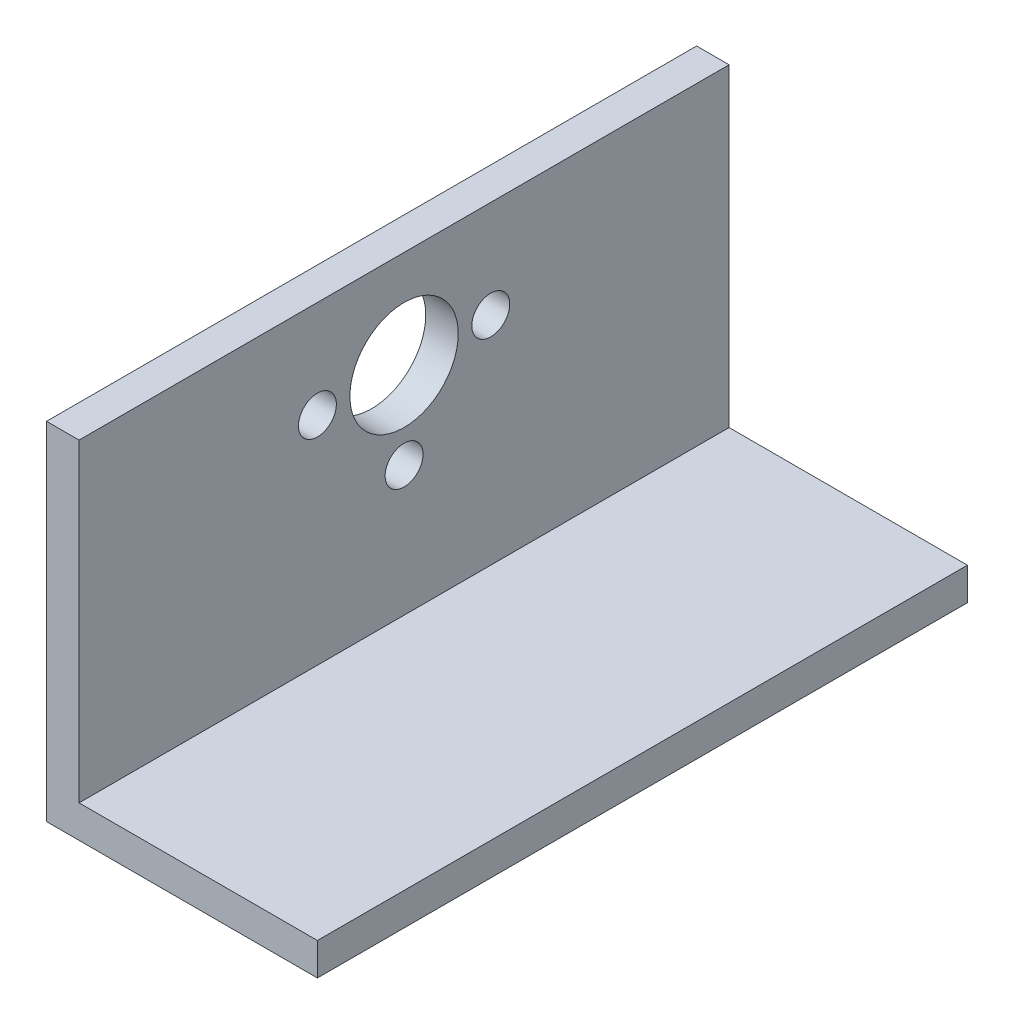
ISO-10303-21;
HEADER;
FILE_DESCRIPTION(('STEP AP214'),'2;1');
FILE_NAME('part.step','',(''),(''),'','','');
FILE_SCHEMA(('AUTOMOTIVE_DESIGN { 1 0 10303 214 1 1 1 1 }'));
ENDSEC;
DATA;
#1=APPLICATION_CONTEXT('core data for automotive mechanical design processes');
#2=APPLICATION_PROTOCOL_DEFINITION('international standard','automotive_design',2000,#1);
#3=PRODUCT_CONTEXT('',#1,'mechanical');
#4=PRODUCT('Part','Part','',(#3));
#5=PRODUCT_RELATED_PRODUCT_CATEGORY('part','',(#4));
#6=PRODUCT_DEFINITION_FORMATION('','',#4);
#7=PRODUCT_DEFINITION_CONTEXT('part definition',#1,'design');
#8=PRODUCT_DEFINITION('design','',#6,#7);
#9=PRODUCT_DEFINITION_SHAPE('','',#8);
#10=(LENGTH_UNIT() NAMED_UNIT(*) SI_UNIT(.MILLI.,.METRE.));
#11=(NAMED_UNIT(*) PLANE_ANGLE_UNIT() SI_UNIT($,.RADIAN.));
#12=(NAMED_UNIT(*) SI_UNIT($,.STERADIAN.) SOLID_ANGLE_UNIT());
#13=UNCERTAINTY_MEASURE_WITH_UNIT(LENGTH_MEASURE(1.E-05),#10,'distance_accuracy_value','');
#14=(GEOMETRIC_REPRESENTATION_CONTEXT(3) GLOBAL_UNCERTAINTY_ASSIGNED_CONTEXT((#13)) GLOBAL_UNIT_ASSIGNED_CONTEXT((#10,
#11,#12)) REPRESENTATION_CONTEXT('',''));
#15=CARTESIAN_POINT('',(0.,0.,0.));
#16=DIRECTION('',(0.,0.,1.));
#17=DIRECTION('',(1.,0.,0.));
#18=AXIS2_PLACEMENT_3D('',#15,#16,#17);
#19=CARTESIAN_POINT('',(-10.8974850351584,31.3475628083256,60.));
#20=DIRECTION('',(0.,-1.,0.));
#21=DIRECTION('',(0.,0.,-1.));
#22=AXIS2_PLACEMENT_3D('',#19,#20,#21);
#23=PLANE('',#22);
#24=DIRECTION('',(-1.,0.,0.));
#25=VECTOR('',#24,1.);
#26=CARTESIAN_POINT('',(-10.8974850351584,31.3475628083256,0.));
#27=LINE('',#26,#25);
#28=CARTESIAN_POINT('',(-7.89748503515838,31.3475628083256,0.));
#29=VERTEX_POINT('',#28);
#30=CARTESIAN_POINT('',(-10.8974850351584,31.3475628083256,0.));
#31=VERTEX_POINT('',#30);
#32=EDGE_CURVE('E117',#29,#31,#27,.T.);
#33=ORIENTED_EDGE('',*,*,#32,.T.);
#34=DIRECTION('',(0.,0.,-1.));
#35=VECTOR('',#34,1.);
#36=CARTESIAN_POINT('',(-10.8974850351584,31.3475628083256,60.));
#37=LINE('',#36,#35);
#38=CARTESIAN_POINT('',(-10.8974850351584,31.3475628083256,60.));
#39=VERTEX_POINT('',#38);
#40=EDGE_CURVE('E11',#39,#31,#37,.T.);
#41=ORIENTED_EDGE('',*,*,#40,.F.);
#42=DIRECTION('',(-1.,0.,0.));
#43=VECTOR('',#42,1.);
#44=CARTESIAN_POINT('',(-10.8974850351584,31.3475628083256,60.));
#45=LINE('',#44,#43);
#46=CARTESIAN_POINT('',(-7.89748503515838,31.3475628083256,60.));
#47=VERTEX_POINT('',#46);
#48=EDGE_CURVE('E128',#47,#39,#45,.T.);
#49=ORIENTED_EDGE('',*,*,#48,.F.);
#50=DIRECTION('',(0.,0.,-1.));
#51=VECTOR('',#50,1.);
#52=CARTESIAN_POINT('',(-7.89748503515838,31.3475628083256,60.));
#53=LINE('',#52,#51);
#54=EDGE_CURVE('E113',#47,#29,#53,.T.);
#55=ORIENTED_EDGE('',*,*,#54,.T.);
#56=EDGE_LOOP('',(#33,#41,#49,#55));
#57=FACE_BOUND('',#56,.T.);
#58=ADVANCED_FACE('F33',(#57),#23,.F.);
#59=CARTESIAN_POINT('',(-10.8974850351584,-0.652437191674368,60.));
#60=DIRECTION('',(1.,0.,0.));
#61=DIRECTION('',(0.,0.,-1.));
#62=AXIS2_PLACEMENT_3D('',#59,#60,#61);
#63=PLANE('',#62);
#64=CARTESIAN_POINT('',(-10.8974850351584,22.3475628083256,22.));
#65=DIRECTION('',(1.,0.,0.));
#66=DIRECTION('',(0.,0.,-1.));
#67=AXIS2_PLACEMENT_3D('',#64,#65,#66);
#68=CIRCLE('',#67,1.75);
#69=CARTESIAN_POINT('',(-10.8974850351584,22.3475628083256,20.25));
#70=VERTEX_POINT('',#69);
#71=EDGE_CURVE('E245',#70,#70,#68,.T.);
#72=ORIENTED_EDGE('',*,*,#71,.T.);
#73=EDGE_LOOP('',(#72));
#74=FACE_BOUND('',#73,.T.);
#75=CARTESIAN_POINT('',(-10.8974850351584,22.3475628083256,38.));
#76=DIRECTION('',(1.,0.,0.));
#77=DIRECTION('',(0.,0.,-1.));
#78=AXIS2_PLACEMENT_3D('',#75,#76,#77);
#79=CIRCLE('',#78,1.75);
#80=CARTESIAN_POINT('',(-10.8974850351584,22.3475628083256,36.25));
#81=VERTEX_POINT('',#80);
#82=EDGE_CURVE('E254',#81,#81,#79,.T.);
#83=ORIENTED_EDGE('',*,*,#82,.T.);
#84=EDGE_LOOP('',(#83));
#85=FACE_BOUND('',#84,.T.);
#86=CARTESIAN_POINT('',(-10.8974850351584,14.3475628083256,30.));
#87=DIRECTION('',(1.,0.,0.));
#88=DIRECTION('',(0.,0.,-1.));
#89=AXIS2_PLACEMENT_3D('',#86,#87,#88);
#90=CIRCLE('',#89,1.75);
#91=CARTESIAN_POINT('',(-10.8974850351584,14.3475628083256,28.25));
#92=VERTEX_POINT('',#91);
#93=EDGE_CURVE('E260',#92,#92,#90,.T.);
#94=ORIENTED_EDGE('',*,*,#93,.T.);
#95=EDGE_LOOP('',(#94));
#96=FACE_BOUND('',#95,.T.);
#97=CARTESIAN_POINT('',(-10.8974850351584,22.3475628083256,30.));
#98=DIRECTION('',(1.,0.,0.));
#99=DIRECTION('',(0.,0.,-1.));
#100=AXIS2_PLACEMENT_3D('',#97,#98,#99);
#101=CIRCLE('',#100,5.);
#102=CARTESIAN_POINT('',(-10.8974850351584,22.3475628083256,25.));
#103=VERTEX_POINT('',#102);
#104=EDGE_CURVE('E121',#103,#103,#101,.T.);
#105=ORIENTED_EDGE('',*,*,#104,.T.);
#106=EDGE_LOOP('',(#105));
#107=FACE_BOUND('',#106,.T.);
#108=DIRECTION('',(0.,-1.,0.));
#109=VECTOR('',#108,1.);
#110=CARTESIAN_POINT('',(-10.8974850351584,-0.652437191674368,0.));
#111=LINE('',#110,#109);
#112=CARTESIAN_POINT('',(-10.8974850351584,-0.652437191674368,0.));
#113=VERTEX_POINT('',#112);
#114=EDGE_CURVE('E120',#31,#113,#111,.T.);
#115=ORIENTED_EDGE('',*,*,#114,.T.);
#116=DIRECTION('',(0.,0.,-1.));
#117=VECTOR('',#116,1.);
#118=CARTESIAN_POINT('',(-10.8974850351584,-0.652437191674368,60.));
#119=LINE('',#118,#117);
#120=CARTESIAN_POINT('',(-10.8974850351584,-0.652437191674368,60.));
#121=VERTEX_POINT('',#120);
#122=EDGE_CURVE('E41',#121,#113,#119,.T.);
#123=ORIENTED_EDGE('',*,*,#122,.F.);
#124=DIRECTION('',(0.,-1.,0.));
#125=VECTOR('',#124,1.);
#126=CARTESIAN_POINT('',(-10.8974850351584,-0.652437191674368,60.));
#127=LINE('',#126,#125);
#128=EDGE_CURVE('E86',#39,#121,#127,.T.);
#129=ORIENTED_EDGE('',*,*,#128,.F.);
#130=ORIENTED_EDGE('',*,*,#40,.T.);
#131=EDGE_LOOP('',(#115,#123,#129,#130));
#132=FACE_BOUND('',#131,.T.);
#133=ADVANCED_FACE('F155',(#74,#85,#96,#107,#132),#63,.F.);
#134=CARTESIAN_POINT('',(14.1025149648416,-0.652437191674365,60.));
#135=DIRECTION('',(0.,1.,0.));
#136=DIRECTION('',(-1.,0.,0.));
#137=AXIS2_PLACEMENT_3D('',#134,#135,#136);
#138=PLANE('',#137);
#139=DIRECTION('',(1.,0.,0.));
#140=VECTOR('',#139,1.);
#141=CARTESIAN_POINT('',(14.1025149648416,-0.652437191674365,0.));
#142=LINE('',#141,#140);
#143=CARTESIAN_POINT('',(14.1025149648416,-0.652437191674365,0.));
#144=VERTEX_POINT('',#143);
#145=EDGE_CURVE('E123',#113,#144,#142,.T.);
#146=ORIENTED_EDGE('',*,*,#145,.T.);
#147=DIRECTION('',(0.,0.,-1.));
#148=VECTOR('',#147,1.);
#149=CARTESIAN_POINT('',(14.1025149648416,-0.652437191674365,60.));
#150=LINE('',#149,#148);
#151=CARTESIAN_POINT('',(14.1025149648416,-0.652437191674365,60.));
#152=VERTEX_POINT('',#151);
#153=EDGE_CURVE('E108',#152,#144,#150,.T.);
#154=ORIENTED_EDGE('',*,*,#153,.F.);
#155=DIRECTION('',(1.,0.,0.));
#156=VECTOR('',#155,1.);
#157=CARTESIAN_POINT('',(14.1025149648416,-0.652437191674365,60.));
#158=LINE('',#157,#156);
#159=EDGE_CURVE('E99',#121,#152,#158,.T.);
#160=ORIENTED_EDGE('',*,*,#159,.F.);
#161=ORIENTED_EDGE('',*,*,#122,.T.);
#162=EDGE_LOOP('',(#146,#154,#160,#161));
#163=FACE_BOUND('',#162,.T.);
#164=ADVANCED_FACE('F134',(#163),#138,.F.);
#165=CARTESIAN_POINT('',(14.1025149648416,2.34756280832563,60.));
#166=DIRECTION('',(-1.,0.,0.));
#167=DIRECTION('',(0.,-1.,0.));
#168=AXIS2_PLACEMENT_3D('',#165,#166,#167);
#169=PLANE('',#168);
#170=DIRECTION('',(0.,1.,0.));
#171=VECTOR('',#170,1.);
#172=CARTESIAN_POINT('',(14.1025149648416,2.34756280832563,0.));
#173=LINE('',#172,#171);
#174=CARTESIAN_POINT('',(14.1025149648416,2.34756280832563,0.));
#175=VERTEX_POINT('',#174);
#176=EDGE_CURVE('E107',#144,#175,#173,.T.);
#177=ORIENTED_EDGE('',*,*,#176,.T.);
#178=DIRECTION('',(0.,0.,-1.));
#179=VECTOR('',#178,1.);
#180=CARTESIAN_POINT('',(14.1025149648416,2.34756280832563,60.));
#181=LINE('',#180,#179);
#182=CARTESIAN_POINT('',(14.1025149648416,2.34756280832563,60.));
#183=VERTEX_POINT('',#182);
#184=EDGE_CURVE('E104',#183,#175,#181,.T.);
#185=ORIENTED_EDGE('',*,*,#184,.F.);
#186=DIRECTION('',(0.,1.,0.));
#187=VECTOR('',#186,1.);
#188=CARTESIAN_POINT('',(14.1025149648416,2.34756280832563,60.));
#189=LINE('',#188,#187);
#190=EDGE_CURVE('E93',#152,#183,#189,.T.);
#191=ORIENTED_EDGE('',*,*,#190,.F.);
#192=ORIENTED_EDGE('',*,*,#153,.T.);
#193=EDGE_LOOP('',(#177,#185,#191,#192));
#194=FACE_BOUND('',#193,.T.);
#195=ADVANCED_FACE('F105',(#194),#169,.F.);
#196=CARTESIAN_POINT('',(-7.89748503515838,2.34756280832563,60.));
#197=DIRECTION('',(0.,-1.,0.));
#198=DIRECTION('',(1.,0.,0.));
#199=AXIS2_PLACEMENT_3D('',#196,#197,#198);
#200=PLANE('',#199);
#201=DIRECTION('',(-1.,0.,0.));
#202=VECTOR('',#201,1.);
#203=CARTESIAN_POINT('',(-7.89748503515838,2.34756280832563,0.));
#204=LINE('',#203,#202);
#205=CARTESIAN_POINT('',(-7.89748503515838,2.34756280832563,0.));
#206=VERTEX_POINT('',#205);
#207=EDGE_CURVE('E72',#175,#206,#204,.T.);
#208=ORIENTED_EDGE('',*,*,#207,.T.);
#209=DIRECTION('',(0.,0.,-1.));
#210=VECTOR('',#209,1.);
#211=CARTESIAN_POINT('',(-7.89748503515838,2.34756280832563,60.));
#212=LINE('',#211,#210);
#213=CARTESIAN_POINT('',(-7.89748503515838,2.34756280832563,60.));
#214=VERTEX_POINT('',#213);
#215=EDGE_CURVE('E109',#214,#206,#212,.T.);
#216=ORIENTED_EDGE('',*,*,#215,.F.);
#217=DIRECTION('',(-1.,0.,0.));
#218=VECTOR('',#217,1.);
#219=CARTESIAN_POINT('',(-7.89748503515838,2.34756280832563,60.));
#220=LINE('',#219,#218);
#221=EDGE_CURVE('E97',#183,#214,#220,.T.);
#222=ORIENTED_EDGE('',*,*,#221,.F.);
#223=ORIENTED_EDGE('',*,*,#184,.T.);
#224=EDGE_LOOP('',(#208,#216,#222,#223));
#225=FACE_BOUND('',#224,.T.);
#226=ADVANCED_FACE('F111',(#225),#200,.F.);
#227=CARTESIAN_POINT('',(-7.89748503515838,31.3475628083256,60.));
#228=DIRECTION('',(-1.,0.,0.));
#229=DIRECTION('',(0.,0.,1.));
#230=AXIS2_PLACEMENT_3D('',#227,#228,#229);
#231=PLANE('',#230);
#232=CARTESIAN_POINT('',(-7.89748503515838,22.3475628083256,22.));
#233=DIRECTION('',(1.,0.,0.));
#234=DIRECTION('',(0.,0.,-1.));
#235=AXIS2_PLACEMENT_3D('',#232,#233,#234);
#236=CIRCLE('',#235,1.75);
#237=CARTESIAN_POINT('',(-7.89748503515838,22.3475628083256,20.25));
#238=VERTEX_POINT('',#237);
#239=EDGE_CURVE('E247',#238,#238,#236,.T.);
#240=ORIENTED_EDGE('',*,*,#239,.F.);
#241=EDGE_LOOP('',(#240));
#242=FACE_BOUND('',#241,.T.);
#243=CARTESIAN_POINT('',(-7.89748503515838,22.3475628083256,38.));
#244=DIRECTION('',(1.,0.,0.));
#245=DIRECTION('',(0.,0.,-1.));
#246=AXIS2_PLACEMENT_3D('',#243,#244,#245);
#247=CIRCLE('',#246,1.75);
#248=CARTESIAN_POINT('',(-7.89748503515838,22.3475628083256,36.25));
#249=VERTEX_POINT('',#248);
#250=EDGE_CURVE('E249',#249,#249,#247,.T.);
#251=ORIENTED_EDGE('',*,*,#250,.F.);
#252=EDGE_LOOP('',(#251));
#253=FACE_BOUND('',#252,.T.);
#254=CARTESIAN_POINT('',(-7.89748503515838,14.3475628083256,30.));
#255=DIRECTION('',(1.,0.,0.));
#256=DIRECTION('',(0.,0.,-1.));
#257=AXIS2_PLACEMENT_3D('',#254,#255,#256);
#258=CIRCLE('',#257,1.75);
#259=CARTESIAN_POINT('',(-7.89748503515838,14.3475628083256,28.25));
#260=VERTEX_POINT('',#259);
#261=EDGE_CURVE('E257',#260,#260,#258,.T.);
#262=ORIENTED_EDGE('',*,*,#261,.F.);
#263=EDGE_LOOP('',(#262));
#264=FACE_BOUND('',#263,.T.);
#265=CARTESIAN_POINT('',(-7.89748503515838,22.3475628083256,30.));
#266=DIRECTION('',(1.,0.,0.));
#267=DIRECTION('',(0.,0.,-1.));
#268=AXIS2_PLACEMENT_3D('',#265,#266,#267);
#269=CIRCLE('',#268,5.);
#270=CARTESIAN_POINT('',(-7.89748503515838,22.3475628083256,25.));
#271=VERTEX_POINT('',#270);
#272=EDGE_CURVE('E263',#271,#271,#269,.T.);
#273=ORIENTED_EDGE('',*,*,#272,.F.);
#274=EDGE_LOOP('',(#273));
#275=FACE_BOUND('',#274,.T.);
#276=DIRECTION('',(0.,1.,0.));
#277=VECTOR('',#276,1.);
#278=CARTESIAN_POINT('',(-7.89748503515838,31.3475628083256,0.));
#279=LINE('',#278,#277);
#280=EDGE_CURVE('E78',#206,#29,#279,.T.);
#281=ORIENTED_EDGE('',*,*,#280,.T.);
#282=ORIENTED_EDGE('',*,*,#54,.F.);
#283=DIRECTION('',(0.,1.,0.));
#284=VECTOR('',#283,1.);
#285=CARTESIAN_POINT('',(-7.89748503515838,31.3475628083256,60.));
#286=LINE('',#285,#284);
#287=EDGE_CURVE('E49',#214,#47,#286,.T.);
#288=ORIENTED_EDGE('',*,*,#287,.F.);
#289=ORIENTED_EDGE('',*,*,#215,.T.);
#290=EDGE_LOOP('',(#281,#282,#288,#289));
#291=FACE_BOUND('',#290,.T.);
#292=ADVANCED_FACE('F141',(#242,#253,#264,#275,#291),#231,.F.);
#293=CARTESIAN_POINT('',(0.,0.,60.));
#294=DIRECTION('',(0.,0.,-1.));
#295=DIRECTION('',(-1.,0.,0.));
#296=AXIS2_PLACEMENT_3D('',#293,#294,#295);
#297=PLANE('',#296);
#298=ORIENTED_EDGE('',*,*,#48,.T.);
#299=ORIENTED_EDGE('',*,*,#128,.T.);
#300=ORIENTED_EDGE('',*,*,#159,.T.);
#301=ORIENTED_EDGE('',*,*,#190,.T.);
#302=ORIENTED_EDGE('',*,*,#221,.T.);
#303=ORIENTED_EDGE('',*,*,#287,.T.);
#304=EDGE_LOOP('',(#298,#299,#300,#301,#302,#303));
#305=FACE_BOUND('',#304,.T.);
#306=ADVANCED_FACE('F95',(#305),#297,.F.);
#307=CARTESIAN_POINT('',(0.,0.,0.));
#308=DIRECTION('',(0.,0.,-1.));
#309=DIRECTION('',(-1.,0.,0.));
#310=AXIS2_PLACEMENT_3D('',#307,#308,#309);
#311=PLANE('',#310);
#312=ORIENTED_EDGE('',*,*,#32,.F.);
#313=ORIENTED_EDGE('',*,*,#280,.F.);
#314=ORIENTED_EDGE('',*,*,#207,.F.);
#315=ORIENTED_EDGE('',*,*,#176,.F.);
#316=ORIENTED_EDGE('',*,*,#145,.F.);
#317=ORIENTED_EDGE('',*,*,#114,.F.);
#318=EDGE_LOOP('',(#312,#313,#314,#315,#316,#317));
#319=FACE_BOUND('',#318,.T.);
#320=ADVANCED_FACE('F137',(#319),#311,.T.);
#321=CARTESIAN_POINT('',(-7.89748503515838,22.3475628083256,30.));
#322=DIRECTION('',(1.,0.,0.));
#323=DIRECTION('',(0.,0.,-1.));
#324=AXIS2_PLACEMENT_3D('',#321,#322,#323);
#325=CYLINDRICAL_SURFACE('',#324,5.);
#326=ORIENTED_EDGE('',*,*,#104,.F.);
#327=EDGE_LOOP('',(#326));
#328=FACE_BOUND('',#327,.T.);
#329=ORIENTED_EDGE('',*,*,#272,.T.);
#330=EDGE_LOOP('',(#329));
#331=FACE_BOUND('',#330,.T.);
#332=ADVANCED_FACE('F192',(#328,#331),#325,.F.);
#333=CARTESIAN_POINT('',(-7.89748503515838,14.3475628083256,30.));
#334=DIRECTION('',(1.,0.,0.));
#335=DIRECTION('',(0.,0.,-1.));
#336=AXIS2_PLACEMENT_3D('',#333,#334,#335);
#337=CYLINDRICAL_SURFACE('',#336,1.75);
#338=ORIENTED_EDGE('',*,*,#93,.F.);
#339=EDGE_LOOP('',(#338));
#340=FACE_BOUND('',#339,.T.);
#341=ORIENTED_EDGE('',*,*,#261,.T.);
#342=EDGE_LOOP('',(#341));
#343=FACE_BOUND('',#342,.T.);
#344=ADVANCED_FACE('F199',(#340,#343),#337,.F.);
#345=CARTESIAN_POINT('',(-7.89748503515838,22.3475628083256,38.));
#346=DIRECTION('',(1.,0.,0.));
#347=DIRECTION('',(0.,0.,-1.));
#348=AXIS2_PLACEMENT_3D('',#345,#346,#347);
#349=CYLINDRICAL_SURFACE('',#348,1.75);
#350=ORIENTED_EDGE('',*,*,#82,.F.);
#351=EDGE_LOOP('',(#350));
#352=FACE_BOUND('',#351,.T.);
#353=ORIENTED_EDGE('',*,*,#250,.T.);
#354=EDGE_LOOP('',(#353));
#355=FACE_BOUND('',#354,.T.);
#356=ADVANCED_FACE('F219',(#352,#355),#349,.F.);
#357=CARTESIAN_POINT('',(-7.89748503515838,22.3475628083256,22.));
#358=DIRECTION('',(1.,0.,0.));
#359=DIRECTION('',(0.,0.,-1.));
#360=AXIS2_PLACEMENT_3D('',#357,#358,#359);
#361=CYLINDRICAL_SURFACE('',#360,1.75);
#362=ORIENTED_EDGE('',*,*,#71,.F.);
#363=EDGE_LOOP('',(#362));
#364=FACE_BOUND('',#363,.T.);
#365=ORIENTED_EDGE('',*,*,#239,.T.);
#366=EDGE_LOOP('',(#365));
#367=FACE_BOUND('',#366,.T.);
#368=ADVANCED_FACE('F229',(#364,#367),#361,.F.);
#369=CLOSED_SHELL('',(#58,#133,#164,#195,#226,#292,#306,#320,#332,#344,#356,#368));
#370=MANIFOLD_SOLID_BREP('B2',#369);
#371=ADVANCED_BREP_SHAPE_REPRESENTATION('',(#18,#370),#14);
#372=SHAPE_DEFINITION_REPRESENTATION(#9,#371);
ENDSEC;
END-ISO-10303-21;
